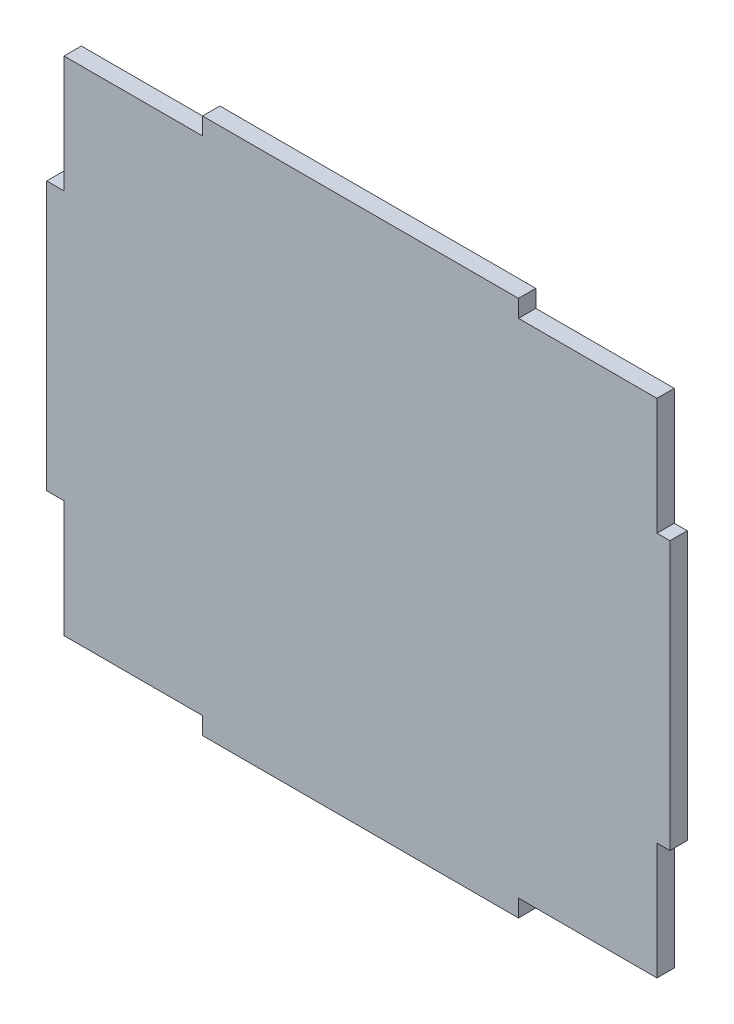
ISO-10303-21;
HEADER;
FILE_DESCRIPTION(('STEP AP214'),'2;1');
FILE_NAME('part.step','',(''),(''),'','','');
FILE_SCHEMA(('AUTOMOTIVE_DESIGN { 1 0 10303 214 1 1 1 1 }'));
ENDSEC;
DATA;
#1=APPLICATION_CONTEXT('core data for automotive mechanical design processes');
#2=APPLICATION_PROTOCOL_DEFINITION('international standard','automotive_design',2000,#1);
#3=PRODUCT_CONTEXT('',#1,'mechanical');
#4=PRODUCT('Part','Part','',(#3));
#5=PRODUCT_RELATED_PRODUCT_CATEGORY('part','',(#4));
#6=PRODUCT_DEFINITION_FORMATION('','',#4);
#7=PRODUCT_DEFINITION_CONTEXT('part definition',#1,'design');
#8=PRODUCT_DEFINITION('design','',#6,#7);
#9=PRODUCT_DEFINITION_SHAPE('','',#8);
#10=(LENGTH_UNIT() NAMED_UNIT(*) SI_UNIT(.MILLI.,.METRE.));
#11=(NAMED_UNIT(*) PLANE_ANGLE_UNIT() SI_UNIT($,.RADIAN.));
#12=(NAMED_UNIT(*) SI_UNIT($,.STERADIAN.) SOLID_ANGLE_UNIT());
#13=UNCERTAINTY_MEASURE_WITH_UNIT(LENGTH_MEASURE(1.E-05),#10,'distance_accuracy_value','');
#14=(GEOMETRIC_REPRESENTATION_CONTEXT(3) GLOBAL_UNCERTAINTY_ASSIGNED_CONTEXT((#13)) GLOBAL_UNIT_ASSIGNED_CONTEXT((#10,
#11,#12)) REPRESENTATION_CONTEXT('',''));
#15=CARTESIAN_POINT('',(0.,0.,0.));
#16=DIRECTION('',(0.,0.,1.));
#17=DIRECTION('',(1.,0.,0.));
#18=AXIS2_PLACEMENT_3D('',#15,#16,#17);
#19=CARTESIAN_POINT('',(-37.0426412226631,40.7362637362637,2.));
#20=DIRECTION('',(1.,0.,0.));
#21=DIRECTION('',(0.,0.,-1.));
#22=AXIS2_PLACEMENT_3D('',#19,#20,#21);
#23=PLANE('',#22);
#24=DIRECTION('',(0.,-1.,0.));
#25=VECTOR('',#24,1.);
#26=CARTESIAN_POINT('',(-37.0426412226631,40.7362637362637,0.));
#27=LINE('',#26,#25);
#28=CARTESIAN_POINT('',(-37.0426412226631,25.2362637362637,0.));
#29=VERTEX_POINT('',#28);
#30=CARTESIAN_POINT('',(-37.0426412226631,-5.76373626373625,0.));
#31=VERTEX_POINT('',#30);
#32=EDGE_CURVE('E296',#29,#31,#27,.T.);
#33=ORIENTED_EDGE('',*,*,#32,.T.);
#34=DIRECTION('',(0.,0.,1.));
#35=VECTOR('',#34,1.);
#36=CARTESIAN_POINT('',(-37.0426412226631,-5.76373626373625,0.));
#37=LINE('',#36,#35);
#38=CARTESIAN_POINT('',(-37.0426412226631,-5.76373626373625,2.));
#39=VERTEX_POINT('',#38);
#40=EDGE_CURVE('E264',#31,#39,#37,.T.);
#41=ORIENTED_EDGE('',*,*,#40,.T.);
#42=DIRECTION('',(0.,-1.,0.));
#43=VECTOR('',#42,1.);
#44=CARTESIAN_POINT('',(-37.0426412226631,40.7362637362637,2.));
#45=LINE('',#44,#43);
#46=CARTESIAN_POINT('',(-37.0426412226631,25.2362637362637,2.));
#47=VERTEX_POINT('',#46);
#48=EDGE_CURVE('E297',#47,#39,#45,.T.);
#49=ORIENTED_EDGE('',*,*,#48,.F.);
#50=DIRECTION('',(0.,0.,1.));
#51=VECTOR('',#50,1.);
#52=CARTESIAN_POINT('',(-37.0426412226631,25.2362637362637,0.));
#53=LINE('',#52,#51);
#54=EDGE_CURVE('E260',#29,#47,#53,.T.);
#55=ORIENTED_EDGE('',*,*,#54,.F.);
#56=EDGE_LOOP('',(#33,#41,#49,#55));
#57=FACE_BOUND('',#56,.T.);
#58=ADVANCED_FACE('F33',(#57),#23,.F.);
#59=CARTESIAN_POINT('',(-37.0426412226631,-21.2637362637363,2.));
#60=DIRECTION('',(0.,1.,0.));
#61=DIRECTION('',(0.,0.,1.));
#62=AXIS2_PLACEMENT_3D('',#59,#60,#61);
#63=PLANE('',#62);
#64=DIRECTION('',(1.,0.,0.));
#65=VECTOR('',#64,1.);
#66=CARTESIAN_POINT('',(-37.0426412226631,-21.2637362637363,2.));
#67=LINE('',#66,#65);
#68=CARTESIAN_POINT('',(-19.0426412226632,-21.2637362637363,2.));
#69=VERTEX_POINT('',#68);
#70=CARTESIAN_POINT('',(17.4573587773369,-21.2637362637363,2.));
#71=VERTEX_POINT('',#70);
#72=EDGE_CURVE('E300',#69,#71,#67,.T.);
#73=ORIENTED_EDGE('',*,*,#72,.F.);
#74=DIRECTION('',(0.,0.,1.));
#75=VECTOR('',#74,1.);
#76=CARTESIAN_POINT('',(-19.0426412226632,-21.2637362637363,0.));
#77=LINE('',#76,#75);
#78=CARTESIAN_POINT('',(-19.0426412226632,-21.2637362637363,0.));
#79=VERTEX_POINT('',#78);
#80=EDGE_CURVE('E217',#79,#69,#77,.T.);
#81=ORIENTED_EDGE('',*,*,#80,.F.);
#82=DIRECTION('',(1.,0.,0.));
#83=VECTOR('',#82,1.);
#84=CARTESIAN_POINT('',(-37.0426412226631,-21.2637362637363,0.));
#85=LINE('',#84,#83);
#86=CARTESIAN_POINT('',(17.4573587773369,-21.2637362637363,0.));
#87=VERTEX_POINT('',#86);
#88=EDGE_CURVE('E313',#79,#87,#85,.T.);
#89=ORIENTED_EDGE('',*,*,#88,.T.);
#90=DIRECTION('',(0.,0.,1.));
#91=VECTOR('',#90,1.);
#92=CARTESIAN_POINT('',(17.4573587773369,-21.2637362637363,0.));
#93=LINE('',#92,#91);
#94=EDGE_CURVE('E173',#87,#71,#93,.T.);
#95=ORIENTED_EDGE('',*,*,#94,.T.);
#96=EDGE_LOOP('',(#73,#81,#89,#95));
#97=FACE_BOUND('',#96,.T.);
#98=ADVANCED_FACE('F388',(#97),#63,.F.);
#99=CARTESIAN_POINT('',(34.9573587773368,40.7362637362637,2.));
#100=DIRECTION('',(-1.,0.,0.));
#101=DIRECTION('',(0.,0.,1.));
#102=AXIS2_PLACEMENT_3D('',#99,#100,#101);
#103=PLANE('',#102);
#104=DIRECTION('',(0.,1.,0.));
#105=VECTOR('',#104,1.);
#106=CARTESIAN_POINT('',(34.9573587773368,40.7362637362637,0.));
#107=LINE('',#106,#105);
#108=CARTESIAN_POINT('',(34.9573587773368,-5.76373626373626,0.));
#109=VERTEX_POINT('',#108);
#110=CARTESIAN_POINT('',(34.9573587773368,25.2362637362637,0.));
#111=VERTEX_POINT('',#110);
#112=EDGE_CURVE('E315',#109,#111,#107,.T.);
#113=ORIENTED_EDGE('',*,*,#112,.T.);
#114=DIRECTION('',(0.,0.,1.));
#115=VECTOR('',#114,1.);
#116=CARTESIAN_POINT('',(34.9573587773368,25.2362637362637,2.));
#117=LINE('',#116,#115);
#118=CARTESIAN_POINT('',(34.9573587773368,25.2362637362637,2.));
#119=VERTEX_POINT('',#118);
#120=EDGE_CURVE('E293',#111,#119,#117,.T.);
#121=ORIENTED_EDGE('',*,*,#120,.T.);
#122=DIRECTION('',(0.,1.,0.));
#123=VECTOR('',#122,1.);
#124=CARTESIAN_POINT('',(34.9573587773368,40.7362637362637,2.));
#125=LINE('',#124,#123);
#126=CARTESIAN_POINT('',(34.9573587773368,-5.76373626373626,2.));
#127=VERTEX_POINT('',#126);
#128=EDGE_CURVE('E304',#127,#119,#125,.T.);
#129=ORIENTED_EDGE('',*,*,#128,.F.);
#130=DIRECTION('',(0.,0.,-1.));
#131=VECTOR('',#130,1.);
#132=CARTESIAN_POINT('',(34.9573587773368,-5.76373626373626,2.));
#133=LINE('',#132,#131);
#134=EDGE_CURVE('E290',#127,#109,#133,.T.);
#135=ORIENTED_EDGE('',*,*,#134,.T.);
#136=EDGE_LOOP('',(#113,#121,#129,#135));
#137=FACE_BOUND('',#136,.T.);
#138=ADVANCED_FACE('F342',(#137),#103,.F.);
#139=CARTESIAN_POINT('',(-37.0426412226631,40.7362637362637,2.));
#140=DIRECTION('',(0.,-1.,0.));
#141=DIRECTION('',(0.,0.,-1.));
#142=AXIS2_PLACEMENT_3D('',#139,#140,#141);
#143=PLANE('',#142);
#144=DIRECTION('',(-1.,0.,0.));
#145=VECTOR('',#144,1.);
#146=CARTESIAN_POINT('',(-37.0426412226631,40.7362637362637,2.));
#147=LINE('',#146,#145);
#148=CARTESIAN_POINT('',(17.4573587773369,40.7362637362637,2.));
#149=VERTEX_POINT('',#148);
#150=CARTESIAN_POINT('',(-19.0426412226632,40.7362637362637,2.));
#151=VERTEX_POINT('',#150);
#152=EDGE_CURVE('E307',#149,#151,#147,.T.);
#153=ORIENTED_EDGE('',*,*,#152,.F.);
#154=DIRECTION('',(0.,0.,1.));
#155=VECTOR('',#154,1.);
#156=CARTESIAN_POINT('',(17.4573587773369,40.7362637362637,0.));
#157=LINE('',#156,#155);
#158=CARTESIAN_POINT('',(17.4573587773369,40.7362637362637,0.));
#159=VERTEX_POINT('',#158);
#160=EDGE_CURVE('E200',#159,#149,#157,.T.);
#161=ORIENTED_EDGE('',*,*,#160,.F.);
#162=DIRECTION('',(-1.,0.,0.));
#163=VECTOR('',#162,1.);
#164=CARTESIAN_POINT('',(-37.0426412226631,40.7362637362637,0.));
#165=LINE('',#164,#163);
#166=CARTESIAN_POINT('',(-19.0426412226632,40.7362637362637,0.));
#167=VERTEX_POINT('',#166);
#168=EDGE_CURVE('E301',#159,#167,#165,.T.);
#169=ORIENTED_EDGE('',*,*,#168,.T.);
#170=DIRECTION('',(0.,0.,1.));
#171=VECTOR('',#170,1.);
#172=CARTESIAN_POINT('',(-19.0426412226632,40.7362637362637,0.));
#173=LINE('',#172,#171);
#174=EDGE_CURVE('E233',#167,#151,#173,.T.);
#175=ORIENTED_EDGE('',*,*,#174,.T.);
#176=EDGE_LOOP('',(#153,#161,#169,#175));
#177=FACE_BOUND('',#176,.T.);
#178=ADVANCED_FACE('F352',(#177),#143,.F.);
#179=CARTESIAN_POINT('',(0.,0.,2.));
#180=DIRECTION('',(0.,0.,1.));
#181=DIRECTION('',(1.,0.,0.));
#182=AXIS2_PLACEMENT_3D('',#179,#180,#181);
#183=PLANE('',#182);
#184=DIRECTION('',(1.,0.,0.));
#185=VECTOR('',#184,1.);
#186=CARTESIAN_POINT('',(35.4573587773369,38.7362637362637,2.));
#187=LINE('',#186,#185);
#188=CARTESIAN_POINT('',(17.4573587773369,38.7362637362637,2.));
#189=VERTEX_POINT('',#188);
#190=CARTESIAN_POINT('',(33.4573587773413,38.7362637362637,2.));
#191=VERTEX_POINT('',#190);
#192=EDGE_CURVE('E54',#189,#191,#187,.T.);
#193=ORIENTED_EDGE('',*,*,#192,.F.);
#194=DIRECTION('',(0.,-1.,0.));
#195=VECTOR('',#194,1.);
#196=CARTESIAN_POINT('',(17.4573587773369,40.7362637362637,2.));
#197=LINE('',#196,#195);
#198=EDGE_CURVE('E201',#149,#189,#197,.T.);
#199=ORIENTED_EDGE('',*,*,#198,.F.);
#200=ORIENTED_EDGE('',*,*,#152,.T.);
#201=DIRECTION('',(0.,1.,0.));
#202=VECTOR('',#201,1.);
#203=CARTESIAN_POINT('',(-19.0426412226632,40.7362637362637,2.));
#204=LINE('',#203,#202);
#205=CARTESIAN_POINT('',(-19.0426412226632,38.7362637362637,2.));
#206=VERTEX_POINT('',#205);
#207=EDGE_CURVE('E227',#206,#151,#204,.T.);
#208=ORIENTED_EDGE('',*,*,#207,.F.);
#209=DIRECTION('',(1.,0.,0.));
#210=VECTOR('',#209,1.);
#211=CARTESIAN_POINT('',(-37.0426412226632,38.7362637362637,2.));
#212=LINE('',#211,#210);
#213=CARTESIAN_POINT('',(-35.0426412226632,38.7362637362637,2.));
#214=VERTEX_POINT('',#213);
#215=EDGE_CURVE('E208',#214,#206,#212,.T.);
#216=ORIENTED_EDGE('',*,*,#215,.F.);
#217=DIRECTION('',(0.,1.,0.));
#218=VECTOR('',#217,1.);
#219=CARTESIAN_POINT('',(-35.0426412226632,40.7362637362637,2.));
#220=LINE('',#219,#218);
#221=CARTESIAN_POINT('',(-35.0426412226632,25.2362637362637,2.));
#222=VERTEX_POINT('',#221);
#223=EDGE_CURVE('E257',#222,#214,#220,.T.);
#224=ORIENTED_EDGE('',*,*,#223,.F.);
#225=DIRECTION('',(1.,0.,0.));
#226=VECTOR('',#225,1.);
#227=CARTESIAN_POINT('',(-37.0426412226631,25.2362637362637,2.));
#228=LINE('',#227,#226);
#229=EDGE_CURVE('E261',#47,#222,#228,.T.);
#230=ORIENTED_EDGE('',*,*,#229,.F.);
#231=ORIENTED_EDGE('',*,*,#48,.T.);
#232=DIRECTION('',(-1.,0.,0.));
#233=VECTOR('',#232,1.);
#234=CARTESIAN_POINT('',(-37.0426412226631,-5.76373626373625,2.));
#235=LINE('',#234,#233);
#236=CARTESIAN_POINT('',(-35.0426412226632,-5.76373626373625,2.));
#237=VERTEX_POINT('',#236);
#238=EDGE_CURVE('E272',#237,#39,#235,.T.);
#239=ORIENTED_EDGE('',*,*,#238,.F.);
#240=DIRECTION('',(0.,1.,0.));
#241=VECTOR('',#240,1.);
#242=CARTESIAN_POINT('',(-35.0426412226632,-21.2637362637363,2.));
#243=LINE('',#242,#241);
#244=CARTESIAN_POINT('',(-35.0426412226632,-19.2637362637363,2.));
#245=VERTEX_POINT('',#244);
#246=EDGE_CURVE('E236',#245,#237,#243,.T.);
#247=ORIENTED_EDGE('',*,*,#246,.F.);
#248=DIRECTION('',(-1.,0.,0.));
#249=VECTOR('',#248,1.);
#250=CARTESIAN_POINT('',(-37.0426412226632,-19.2637362637363,2.));
#251=LINE('',#250,#249);
#252=CARTESIAN_POINT('',(-19.0426412226632,-19.2637362637363,2.));
#253=VERTEX_POINT('',#252);
#254=EDGE_CURVE('E214',#253,#245,#251,.T.);
#255=ORIENTED_EDGE('',*,*,#254,.F.);
#256=DIRECTION('',(0.,1.,0.));
#257=VECTOR('',#256,1.);
#258=CARTESIAN_POINT('',(-19.0426412226632,-21.2637362637363,2.));
#259=LINE('',#258,#257);
#260=EDGE_CURVE('E193',#69,#253,#259,.T.);
#261=ORIENTED_EDGE('',*,*,#260,.F.);
#262=ORIENTED_EDGE('',*,*,#72,.T.);
#263=DIRECTION('',(0.,-1.,0.));
#264=VECTOR('',#263,1.);
#265=CARTESIAN_POINT('',(17.4573587773369,-21.2637362637363,2.));
#266=LINE('',#265,#264);
#267=CARTESIAN_POINT('',(17.4573587773369,-19.2637362637363,2.));
#268=VERTEX_POINT('',#267);
#269=EDGE_CURVE('E188',#268,#71,#266,.T.);
#270=ORIENTED_EDGE('',*,*,#269,.F.);
#271=DIRECTION('',(-1.,0.,0.));
#272=VECTOR('',#271,1.);
#273=CARTESIAN_POINT('',(35.4573587773369,-19.2637362637363,2.));
#274=LINE('',#273,#272);
#275=CARTESIAN_POINT('',(33.4573587773413,-19.2637362637363,2.));
#276=VERTEX_POINT('',#275);
#277=EDGE_CURVE('E170',#276,#268,#274,.T.);
#278=ORIENTED_EDGE('',*,*,#277,.F.);
#279=DIRECTION('',(0.,-1.,0.));
#280=VECTOR('',#279,1.);
#281=CARTESIAN_POINT('',(33.4573587773413,-21.2637362637363,2.));
#282=LINE('',#281,#280);
#283=CARTESIAN_POINT('',(33.4573587773413,-5.76373626373626,2.));
#284=VERTEX_POINT('',#283);
#285=EDGE_CURVE('E284',#284,#276,#282,.T.);
#286=ORIENTED_EDGE('',*,*,#285,.F.);
#287=DIRECTION('',(-1.,0.,0.));
#288=VECTOR('',#287,1.);
#289=CARTESIAN_POINT('',(35.4573587773413,-5.76373626373626,2.));
#290=LINE('',#289,#288);
#291=EDGE_CURVE('E252',#127,#284,#290,.T.);
#292=ORIENTED_EDGE('',*,*,#291,.F.);
#293=ORIENTED_EDGE('',*,*,#128,.T.);
#294=DIRECTION('',(1.,0.,0.));
#295=VECTOR('',#294,1.);
#296=CARTESIAN_POINT('',(35.4573587773413,25.2362637362637,2.));
#297=LINE('',#296,#295);
#298=CARTESIAN_POINT('',(33.4573587773413,25.2362637362637,2.));
#299=VERTEX_POINT('',#298);
#300=EDGE_CURVE('E242',#299,#119,#297,.T.);
#301=ORIENTED_EDGE('',*,*,#300,.F.);
#302=DIRECTION('',(0.,-1.,0.));
#303=VECTOR('',#302,1.);
#304=CARTESIAN_POINT('',(33.4573587773413,40.7362637362637,2.));
#305=LINE('',#304,#303);
#306=EDGE_CURVE('E246',#191,#299,#305,.T.);
#307=ORIENTED_EDGE('',*,*,#306,.F.);
#308=EDGE_LOOP('',(#193,#199,#200,#208,#216,#224,#230,#231,#239,#247,#255,#261,#262,#270,#278,
#286,#292,#293,#301,#307));
#309=FACE_BOUND('',#308,.T.);
#310=ADVANCED_FACE('F334',(#309),#183,.T.);
#311=CARTESIAN_POINT('',(0.,0.,0.));
#312=DIRECTION('',(0.,0.,1.));
#313=DIRECTION('',(1.,0.,0.));
#314=AXIS2_PLACEMENT_3D('',#311,#312,#313);
#315=PLANE('',#314);
#316=DIRECTION('',(0.,-1.,0.));
#317=VECTOR('',#316,1.);
#318=CARTESIAN_POINT('',(17.4573587773369,40.7362637362637,0.));
#319=LINE('',#318,#317);
#320=CARTESIAN_POINT('',(17.4573587773369,38.7362637362637,0.));
#321=VERTEX_POINT('',#320);
#322=EDGE_CURVE('E195',#159,#321,#319,.T.);
#323=ORIENTED_EDGE('',*,*,#322,.T.);
#324=DIRECTION('',(1.,0.,0.));
#325=VECTOR('',#324,1.);
#326=CARTESIAN_POINT('',(35.4573587773369,38.7362637362637,0.));
#327=LINE('',#326,#325);
#328=CARTESIAN_POINT('',(33.4573587773413,38.7362637362637,0.));
#329=VERTEX_POINT('',#328);
#330=EDGE_CURVE('E197',#321,#329,#327,.T.);
#331=ORIENTED_EDGE('',*,*,#330,.T.);
#332=DIRECTION('',(0.,-1.,0.));
#333=VECTOR('',#332,1.);
#334=CARTESIAN_POINT('',(33.4573587773413,40.7362637362637,0.));
#335=LINE('',#334,#333);
#336=CARTESIAN_POINT('',(33.4573587773413,25.2362637362637,0.));
#337=VERTEX_POINT('',#336);
#338=EDGE_CURVE('E239',#329,#337,#335,.T.);
#339=ORIENTED_EDGE('',*,*,#338,.T.);
#340=DIRECTION('',(1.,0.,0.));
#341=VECTOR('',#340,1.);
#342=CARTESIAN_POINT('',(35.4573587773413,25.2362637362637,0.));
#343=LINE('',#342,#341);
#344=EDGE_CURVE('E241',#337,#111,#343,.T.);
#345=ORIENTED_EDGE('',*,*,#344,.T.);
#346=ORIENTED_EDGE('',*,*,#112,.F.);
#347=DIRECTION('',(-1.,0.,0.));
#348=VECTOR('',#347,1.);
#349=CARTESIAN_POINT('',(0.,-5.76373626373626,0.));
#350=LINE('',#349,#348);
#351=CARTESIAN_POINT('',(33.4573587773413,-5.76373626373626,0.));
#352=VERTEX_POINT('',#351);
#353=EDGE_CURVE('E310',#109,#352,#350,.T.);
#354=ORIENTED_EDGE('',*,*,#353,.T.);
#355=DIRECTION('',(0.,-1.,0.));
#356=VECTOR('',#355,1.);
#357=CARTESIAN_POINT('',(33.4573587773413,-21.2637362637363,0.));
#358=LINE('',#357,#356);
#359=CARTESIAN_POINT('',(33.4573587773413,-19.2637362637363,0.));
#360=VERTEX_POINT('',#359);
#361=EDGE_CURVE('E187',#352,#360,#358,.T.);
#362=ORIENTED_EDGE('',*,*,#361,.T.);
#363=DIRECTION('',(-1.,0.,0.));
#364=VECTOR('',#363,1.);
#365=CARTESIAN_POINT('',(35.4573587773369,-19.2637362637363,0.));
#366=LINE('',#365,#364);
#367=CARTESIAN_POINT('',(17.4573587773369,-19.2637362637363,0.));
#368=VERTEX_POINT('',#367);
#369=EDGE_CURVE('E47',#360,#368,#366,.T.);
#370=ORIENTED_EDGE('',*,*,#369,.T.);
#371=DIRECTION('',(0.,-1.,0.));
#372=VECTOR('',#371,1.);
#373=CARTESIAN_POINT('',(17.4573587773369,-21.2637362637363,0.));
#374=LINE('',#373,#372);
#375=EDGE_CURVE('E174',#368,#87,#374,.T.);
#376=ORIENTED_EDGE('',*,*,#375,.T.);
#377=ORIENTED_EDGE('',*,*,#88,.F.);
#378=DIRECTION('',(0.,1.,0.));
#379=VECTOR('',#378,1.);
#380=CARTESIAN_POINT('',(-19.0426412226632,-21.2637362637363,0.));
#381=LINE('',#380,#379);
#382=CARTESIAN_POINT('',(-19.0426412226632,-19.2637362637363,0.));
#383=VERTEX_POINT('',#382);
#384=EDGE_CURVE('E210',#79,#383,#381,.T.);
#385=ORIENTED_EDGE('',*,*,#384,.T.);
#386=DIRECTION('',(-1.,0.,0.));
#387=VECTOR('',#386,1.);
#388=CARTESIAN_POINT('',(-37.0426412226632,-19.2637362637363,0.));
#389=LINE('',#388,#387);
#390=CARTESIAN_POINT('',(-35.0426412226632,-19.2637362637363,0.));
#391=VERTEX_POINT('',#390);
#392=EDGE_CURVE('E213',#383,#391,#389,.T.);
#393=ORIENTED_EDGE('',*,*,#392,.T.);
#394=DIRECTION('',(0.,1.,0.));
#395=VECTOR('',#394,1.);
#396=CARTESIAN_POINT('',(-35.0426412226632,-21.2637362637363,0.));
#397=LINE('',#396,#395);
#398=CARTESIAN_POINT('',(-35.0426412226632,-5.76373626373625,0.));
#399=VERTEX_POINT('',#398);
#400=EDGE_CURVE('E269',#391,#399,#397,.T.);
#401=ORIENTED_EDGE('',*,*,#400,.T.);
#402=DIRECTION('',(-1.,0.,0.));
#403=VECTOR('',#402,1.);
#404=CARTESIAN_POINT('',(-37.0426412226631,-5.76373626373625,0.));
#405=LINE('',#404,#403);
#406=EDGE_CURVE('E271',#399,#31,#405,.T.);
#407=ORIENTED_EDGE('',*,*,#406,.T.);
#408=ORIENTED_EDGE('',*,*,#32,.F.);
#409=DIRECTION('',(1.,0.,0.));
#410=VECTOR('',#409,1.);
#411=CARTESIAN_POINT('',(-37.0426412226631,25.2362637362637,0.));
#412=LINE('',#411,#410);
#413=CARTESIAN_POINT('',(-35.0426412226632,25.2362637362637,0.));
#414=VERTEX_POINT('',#413);
#415=EDGE_CURVE('E253',#29,#414,#412,.T.);
#416=ORIENTED_EDGE('',*,*,#415,.T.);
#417=DIRECTION('',(0.,1.,0.));
#418=VECTOR('',#417,1.);
#419=CARTESIAN_POINT('',(-35.0426412226632,40.7362637362637,0.));
#420=LINE('',#419,#418);
#421=CARTESIAN_POINT('',(-35.0426412226632,38.7362637362637,0.));
#422=VERTEX_POINT('',#421);
#423=EDGE_CURVE('E256',#414,#422,#420,.T.);
#424=ORIENTED_EDGE('',*,*,#423,.T.);
#425=DIRECTION('',(1.,0.,0.));
#426=VECTOR('',#425,1.);
#427=CARTESIAN_POINT('',(-37.0426412226632,38.7362637362637,0.));
#428=LINE('',#427,#426);
#429=CARTESIAN_POINT('',(-19.0426412226632,38.7362637362637,0.));
#430=VERTEX_POINT('',#429);
#431=EDGE_CURVE('E223',#422,#430,#428,.T.);
#432=ORIENTED_EDGE('',*,*,#431,.T.);
#433=DIRECTION('',(0.,1.,0.));
#434=VECTOR('',#433,1.);
#435=CARTESIAN_POINT('',(-19.0426412226632,40.7362637362637,0.));
#436=LINE('',#435,#434);
#437=EDGE_CURVE('E226',#430,#167,#436,.T.);
#438=ORIENTED_EDGE('',*,*,#437,.T.);
#439=ORIENTED_EDGE('',*,*,#168,.F.);
#440=EDGE_LOOP('',(#323,#331,#339,#345,#346,#354,#362,#370,#376,#377,#385,#393,#401,#407,#408,
#416,#424,#432,#438,#439));
#441=FACE_BOUND('',#440,.T.);
#442=ADVANCED_FACE('F185',(#441),#315,.F.);
#443=CARTESIAN_POINT('',(35.4573587773413,-5.76373626373626,0.));
#444=DIRECTION('',(0.,1.,0.));
#445=DIRECTION('',(0.,0.,1.));
#446=AXIS2_PLACEMENT_3D('',#443,#444,#445);
#447=PLANE('',#446);
#448=ORIENTED_EDGE('',*,*,#291,.T.);
#449=DIRECTION('',(0.,0.,1.));
#450=VECTOR('',#449,1.);
#451=CARTESIAN_POINT('',(33.4573587773413,-5.76373626373626,0.));
#452=LINE('',#451,#450);
#453=EDGE_CURVE('E283',#352,#284,#452,.T.);
#454=ORIENTED_EDGE('',*,*,#453,.F.);
#455=ORIENTED_EDGE('',*,*,#353,.F.);
#456=ORIENTED_EDGE('',*,*,#134,.F.);
#457=EDGE_LOOP('',(#448,#454,#455,#456));
#458=FACE_BOUND('',#457,.T.);
#459=ADVANCED_FACE('F394',(#458),#447,.F.);
#460=CARTESIAN_POINT('',(33.4573587773413,-21.2637362637363,0.));
#461=DIRECTION('',(-1.,0.,0.));
#462=DIRECTION('',(0.,0.,1.));
#463=AXIS2_PLACEMENT_3D('',#460,#461,#462);
#464=PLANE('',#463);
#465=ORIENTED_EDGE('',*,*,#285,.T.);
#466=DIRECTION('',(0.,0.,-1.));
#467=VECTOR('',#466,1.);
#468=CARTESIAN_POINT('',(33.4573587773413,-19.2637362637363,0.));
#469=LINE('',#468,#467);
#470=EDGE_CURVE('E11',#276,#360,#469,.T.);
#471=ORIENTED_EDGE('',*,*,#470,.T.);
#472=ORIENTED_EDGE('',*,*,#361,.F.);
#473=ORIENTED_EDGE('',*,*,#453,.T.);
#474=EDGE_LOOP('',(#465,#471,#472,#473));
#475=FACE_BOUND('',#474,.T.);
#476=ADVANCED_FACE('F391',(#475),#464,.F.);
#477=CARTESIAN_POINT('',(35.4573587773413,25.2362637362637,0.));
#478=DIRECTION('',(0.,-1.,0.));
#479=DIRECTION('',(0.,0.,-1.));
#480=AXIS2_PLACEMENT_3D('',#477,#478,#479);
#481=PLANE('',#480);
#482=ORIENTED_EDGE('',*,*,#344,.F.);
#483=DIRECTION('',(0.,0.,1.));
#484=VECTOR('',#483,1.);
#485=CARTESIAN_POINT('',(33.4573587773413,25.2362637362637,0.));
#486=LINE('',#485,#484);
#487=EDGE_CURVE('E245',#337,#299,#486,.T.);
#488=ORIENTED_EDGE('',*,*,#487,.T.);
#489=ORIENTED_EDGE('',*,*,#300,.T.);
#490=ORIENTED_EDGE('',*,*,#120,.F.);
#491=EDGE_LOOP('',(#482,#488,#489,#490));
#492=FACE_BOUND('',#491,.T.);
#493=ADVANCED_FACE('F340',(#492),#481,.F.);
#494=CARTESIAN_POINT('',(33.4573587773413,40.7362637362637,0.));
#495=DIRECTION('',(-1.,0.,0.));
#496=DIRECTION('',(0.,0.,1.));
#497=AXIS2_PLACEMENT_3D('',#494,#495,#496);
#498=PLANE('',#497);
#499=ORIENTED_EDGE('',*,*,#338,.F.);
#500=DIRECTION('',(0.,0.,1.));
#501=VECTOR('',#500,1.);
#502=CARTESIAN_POINT('',(33.4573587773413,38.7362637362637,0.));
#503=LINE('',#502,#501);
#504=EDGE_CURVE('E40',#329,#191,#503,.T.);
#505=ORIENTED_EDGE('',*,*,#504,.T.);
#506=ORIENTED_EDGE('',*,*,#306,.T.);
#507=ORIENTED_EDGE('',*,*,#487,.F.);
#508=EDGE_LOOP('',(#499,#505,#506,#507));
#509=FACE_BOUND('',#508,.T.);
#510=ADVANCED_FACE('F329',(#509),#498,.F.);
#511=CARTESIAN_POINT('',(-35.0426412226632,40.7362637362637,0.));
#512=DIRECTION('',(1.,0.,0.));
#513=DIRECTION('',(0.,0.,-1.));
#514=AXIS2_PLACEMENT_3D('',#511,#512,#513);
#515=PLANE('',#514);
#516=ORIENTED_EDGE('',*,*,#223,.T.);
#517=DIRECTION('',(0.,0.,-1.));
#518=VECTOR('',#517,1.);
#519=CARTESIAN_POINT('',(-35.0426412226632,38.7362637362637,0.));
#520=LINE('',#519,#518);
#521=EDGE_CURVE('E324',#214,#422,#520,.T.);
#522=ORIENTED_EDGE('',*,*,#521,.T.);
#523=ORIENTED_EDGE('',*,*,#423,.F.);
#524=DIRECTION('',(0.,0.,1.));
#525=VECTOR('',#524,1.);
#526=CARTESIAN_POINT('',(-35.0426412226632,25.2362637362637,0.));
#527=LINE('',#526,#525);
#528=EDGE_CURVE('E248',#414,#222,#527,.T.);
#529=ORIENTED_EDGE('',*,*,#528,.T.);
#530=EDGE_LOOP('',(#516,#522,#523,#529));
#531=FACE_BOUND('',#530,.T.);
#532=ADVANCED_FACE('F360',(#531),#515,.F.);
#533=CARTESIAN_POINT('',(-37.0426412226631,25.2362637362637,0.));
#534=DIRECTION('',(0.,-1.,0.));
#535=DIRECTION('',(0.,0.,-1.));
#536=AXIS2_PLACEMENT_3D('',#533,#534,#535);
#537=PLANE('',#536);
#538=ORIENTED_EDGE('',*,*,#229,.T.);
#539=ORIENTED_EDGE('',*,*,#528,.F.);
#540=ORIENTED_EDGE('',*,*,#415,.F.);
#541=ORIENTED_EDGE('',*,*,#54,.T.);
#542=EDGE_LOOP('',(#538,#539,#540,#541));
#543=FACE_BOUND('',#542,.T.);
#544=ADVANCED_FACE('F448',(#543),#537,.F.);
#545=CARTESIAN_POINT('',(-37.0426412226631,-5.76373626373625,0.));
#546=DIRECTION('',(0.,1.,0.));
#547=DIRECTION('',(0.,0.,1.));
#548=AXIS2_PLACEMENT_3D('',#545,#546,#547);
#549=PLANE('',#548);
#550=ORIENTED_EDGE('',*,*,#238,.T.);
#551=ORIENTED_EDGE('',*,*,#40,.F.);
#552=ORIENTED_EDGE('',*,*,#406,.F.);
#553=DIRECTION('',(0.,0.,1.));
#554=VECTOR('',#553,1.);
#555=CARTESIAN_POINT('',(-35.0426412226632,-5.76373626373625,0.));
#556=LINE('',#555,#554);
#557=EDGE_CURVE('E275',#399,#237,#556,.T.);
#558=ORIENTED_EDGE('',*,*,#557,.T.);
#559=EDGE_LOOP('',(#550,#551,#552,#558));
#560=FACE_BOUND('',#559,.T.);
#561=ADVANCED_FACE('F372',(#560),#549,.F.);
#562=CARTESIAN_POINT('',(-35.0426412226632,-21.2637362637363,0.));
#563=DIRECTION('',(1.,0.,0.));
#564=DIRECTION('',(0.,0.,-1.));
#565=AXIS2_PLACEMENT_3D('',#562,#563,#564);
#566=PLANE('',#565);
#567=ORIENTED_EDGE('',*,*,#400,.F.);
#568=DIRECTION('',(0.,0.,1.));
#569=VECTOR('',#568,1.);
#570=CARTESIAN_POINT('',(-35.0426412226632,-19.2637362637363,0.));
#571=LINE('',#570,#569);
#572=EDGE_CURVE('E321',#391,#245,#571,.T.);
#573=ORIENTED_EDGE('',*,*,#572,.T.);
#574=ORIENTED_EDGE('',*,*,#246,.T.);
#575=ORIENTED_EDGE('',*,*,#557,.F.);
#576=EDGE_LOOP('',(#567,#573,#574,#575));
#577=FACE_BOUND('',#576,.T.);
#578=ADVANCED_FACE('F377',(#577),#566,.F.);
#579=CARTESIAN_POINT('',(-37.0426412226632,-19.2637362637363,0.));
#580=DIRECTION('',(0.,1.,0.));
#581=DIRECTION('',(0.,0.,1.));
#582=AXIS2_PLACEMENT_3D('',#579,#580,#581);
#583=PLANE('',#582);
#584=ORIENTED_EDGE('',*,*,#392,.F.);
#585=DIRECTION('',(0.,0.,1.));
#586=VECTOR('',#585,1.);
#587=CARTESIAN_POINT('',(-19.0426412226632,-19.2637362637363,0.));
#588=LINE('',#587,#586);
#589=EDGE_CURVE('E204',#383,#253,#588,.T.);
#590=ORIENTED_EDGE('',*,*,#589,.T.);
#591=ORIENTED_EDGE('',*,*,#254,.T.);
#592=ORIENTED_EDGE('',*,*,#572,.F.);
#593=EDGE_LOOP('',(#584,#590,#591,#592));
#594=FACE_BOUND('',#593,.T.);
#595=ADVANCED_FACE('F383',(#594),#583,.F.);
#596=CARTESIAN_POINT('',(-19.0426412226632,-21.2637362637363,0.));
#597=DIRECTION('',(1.,0.,0.));
#598=DIRECTION('',(0.,0.,-1.));
#599=AXIS2_PLACEMENT_3D('',#596,#597,#598);
#600=PLANE('',#599);
#601=ORIENTED_EDGE('',*,*,#260,.T.);
#602=ORIENTED_EDGE('',*,*,#589,.F.);
#603=ORIENTED_EDGE('',*,*,#384,.F.);
#604=ORIENTED_EDGE('',*,*,#80,.T.);
#605=EDGE_LOOP('',(#601,#602,#603,#604));
#606=FACE_BOUND('',#605,.T.);
#607=ADVANCED_FACE('F385',(#606),#600,.F.);
#608=CARTESIAN_POINT('',(-37.0426412226632,38.7362637362637,0.));
#609=DIRECTION('',(0.,-1.,0.));
#610=DIRECTION('',(0.,0.,-1.));
#611=AXIS2_PLACEMENT_3D('',#608,#609,#610);
#612=PLANE('',#611);
#613=ORIENTED_EDGE('',*,*,#215,.T.);
#614=DIRECTION('',(0.,0.,1.));
#615=VECTOR('',#614,1.);
#616=CARTESIAN_POINT('',(-19.0426412226632,38.7362637362637,0.));
#617=LINE('',#616,#615);
#618=EDGE_CURVE('E230',#430,#206,#617,.T.);
#619=ORIENTED_EDGE('',*,*,#618,.F.);
#620=ORIENTED_EDGE('',*,*,#431,.F.);
#621=ORIENTED_EDGE('',*,*,#521,.F.);
#622=EDGE_LOOP('',(#613,#619,#620,#621));
#623=FACE_BOUND('',#622,.T.);
#624=ADVANCED_FACE('F357',(#623),#612,.F.);
#625=CARTESIAN_POINT('',(-19.0426412226632,40.7362637362637,0.));
#626=DIRECTION('',(1.,0.,0.));
#627=DIRECTION('',(0.,1.,0.));
#628=AXIS2_PLACEMENT_3D('',#625,#626,#627);
#629=PLANE('',#628);
#630=ORIENTED_EDGE('',*,*,#207,.T.);
#631=ORIENTED_EDGE('',*,*,#174,.F.);
#632=ORIENTED_EDGE('',*,*,#437,.F.);
#633=ORIENTED_EDGE('',*,*,#618,.T.);
#634=EDGE_LOOP('',(#630,#631,#632,#633));
#635=FACE_BOUND('',#634,.T.);
#636=ADVANCED_FACE('F355',(#635),#629,.F.);
#637=CARTESIAN_POINT('',(35.4573587773369,38.7362637362637,0.));
#638=DIRECTION('',(0.,-1.,0.));
#639=DIRECTION('',(0.,0.,-1.));
#640=AXIS2_PLACEMENT_3D('',#637,#638,#639);
#641=PLANE('',#640);
#642=ORIENTED_EDGE('',*,*,#330,.F.);
#643=DIRECTION('',(0.,0.,1.));
#644=VECTOR('',#643,1.);
#645=CARTESIAN_POINT('',(17.4573587773369,38.7362637362637,0.));
#646=LINE('',#645,#644);
#647=EDGE_CURVE('E206',#321,#189,#646,.T.);
#648=ORIENTED_EDGE('',*,*,#647,.T.);
#649=ORIENTED_EDGE('',*,*,#192,.T.);
#650=ORIENTED_EDGE('',*,*,#504,.F.);
#651=EDGE_LOOP('',(#642,#648,#649,#650));
#652=FACE_BOUND('',#651,.T.);
#653=ADVANCED_FACE('F345',(#652),#641,.F.);
#654=CARTESIAN_POINT('',(17.4573587773369,40.7362637362637,0.));
#655=DIRECTION('',(-1.,0.,0.));
#656=DIRECTION('',(0.,0.,1.));
#657=AXIS2_PLACEMENT_3D('',#654,#655,#656);
#658=PLANE('',#657);
#659=ORIENTED_EDGE('',*,*,#198,.T.);
#660=ORIENTED_EDGE('',*,*,#647,.F.);
#661=ORIENTED_EDGE('',*,*,#322,.F.);
#662=ORIENTED_EDGE('',*,*,#160,.T.);
#663=EDGE_LOOP('',(#659,#660,#661,#662));
#664=FACE_BOUND('',#663,.T.);
#665=ADVANCED_FACE('F347',(#664),#658,.F.);
#666=CARTESIAN_POINT('',(35.4573587773369,-19.2637362637363,0.));
#667=DIRECTION('',(0.,1.,0.));
#668=DIRECTION('',(0.,0.,1.));
#669=AXIS2_PLACEMENT_3D('',#666,#667,#668);
#670=PLANE('',#669);
#671=ORIENTED_EDGE('',*,*,#277,.T.);
#672=DIRECTION('',(0.,0.,1.));
#673=VECTOR('',#672,1.);
#674=CARTESIAN_POINT('',(17.4573587773369,-19.2637362637363,0.));
#675=LINE('',#674,#673);
#676=EDGE_CURVE('E166',#368,#268,#675,.T.);
#677=ORIENTED_EDGE('',*,*,#676,.F.);
#678=ORIENTED_EDGE('',*,*,#369,.F.);
#679=ORIENTED_EDGE('',*,*,#470,.F.);
#680=EDGE_LOOP('',(#671,#677,#678,#679));
#681=FACE_BOUND('',#680,.T.);
#682=ADVANCED_FACE('F168',(#681),#670,.F.);
#683=CARTESIAN_POINT('',(17.4573587773369,-21.2637362637363,0.));
#684=DIRECTION('',(-1.,0.,0.));
#685=DIRECTION('',(0.,0.,1.));
#686=AXIS2_PLACEMENT_3D('',#683,#684,#685);
#687=PLANE('',#686);
#688=ORIENTED_EDGE('',*,*,#269,.T.);
#689=ORIENTED_EDGE('',*,*,#94,.F.);
#690=ORIENTED_EDGE('',*,*,#375,.F.);
#691=ORIENTED_EDGE('',*,*,#676,.T.);
#692=EDGE_LOOP('',(#688,#689,#690,#691));
#693=FACE_BOUND('',#692,.T.);
#694=ADVANCED_FACE('F177',(#693),#687,.F.);
#695=CLOSED_SHELL('',(#58,#98,#138,#178,#310,#442,#459,#476,#493,#510,#532,#544,#561,#578,#595,
#607,#624,#636,#653,#665,#682,#694));
#696=MANIFOLD_SOLID_BREP('B2',#695);
#697=ADVANCED_BREP_SHAPE_REPRESENTATION('',(#18,#696),#14);
#698=SHAPE_DEFINITION_REPRESENTATION(#9,#697);
ENDSEC;
END-ISO-10303-21;
